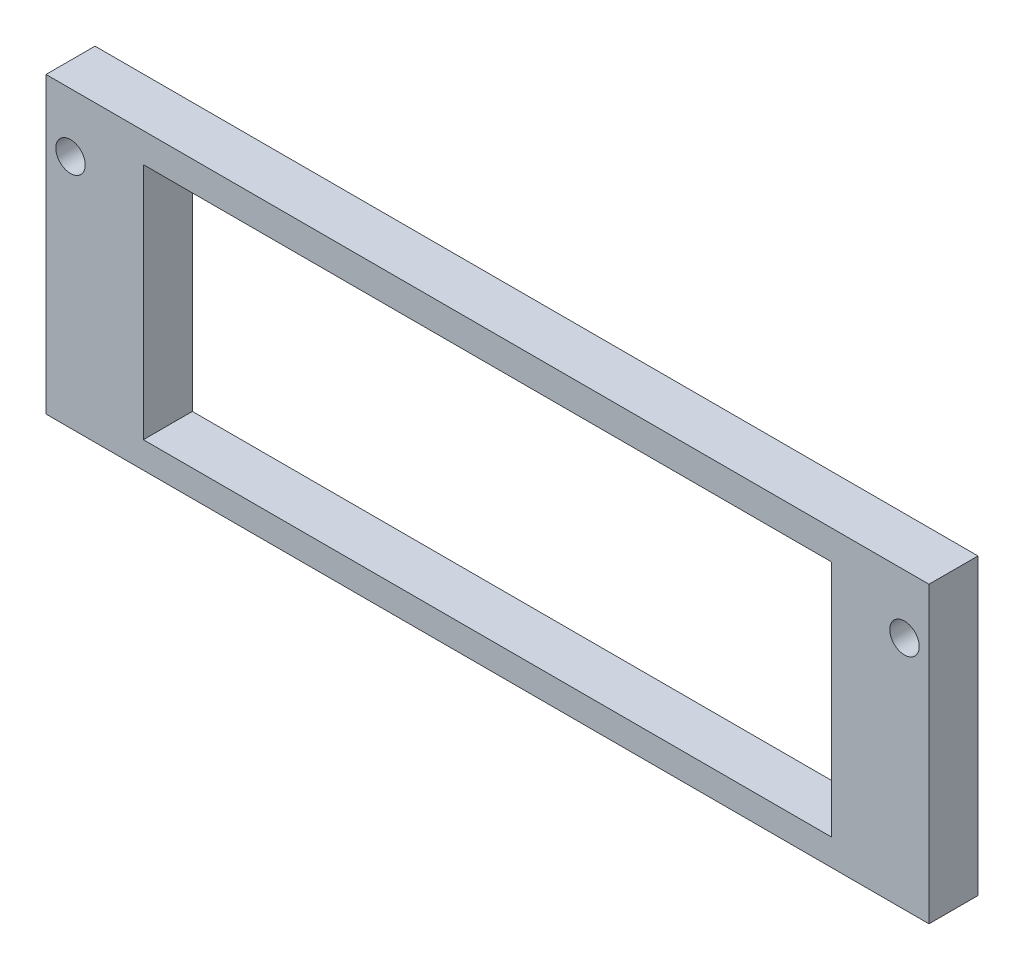
ISO-10303-21;
HEADER;
FILE_DESCRIPTION(('STEP AP214'),'2;1');
FILE_NAME('part.step','',(''),(''),'','','');
FILE_SCHEMA(('AUTOMOTIVE_DESIGN { 1 0 10303 214 1 1 1 1 }'));
ENDSEC;
DATA;
#1=APPLICATION_CONTEXT('core data for automotive mechanical design processes');
#2=APPLICATION_PROTOCOL_DEFINITION('international standard','automotive_design',2000,#1);
#3=PRODUCT_CONTEXT('',#1,'mechanical');
#4=PRODUCT('Part','Part','',(#3));
#5=PRODUCT_RELATED_PRODUCT_CATEGORY('part','',(#4));
#6=PRODUCT_DEFINITION_FORMATION('','',#4);
#7=PRODUCT_DEFINITION_CONTEXT('part definition',#1,'design');
#8=PRODUCT_DEFINITION('design','',#6,#7);
#9=PRODUCT_DEFINITION_SHAPE('','',#8);
#10=(LENGTH_UNIT() NAMED_UNIT(*) SI_UNIT(.MILLI.,.METRE.));
#11=(NAMED_UNIT(*) PLANE_ANGLE_UNIT() SI_UNIT($,.RADIAN.));
#12=(NAMED_UNIT(*) SI_UNIT($,.STERADIAN.) SOLID_ANGLE_UNIT());
#13=UNCERTAINTY_MEASURE_WITH_UNIT(LENGTH_MEASURE(1.E-05),#10,'distance_accuracy_value','');
#14=(GEOMETRIC_REPRESENTATION_CONTEXT(3) GLOBAL_UNCERTAINTY_ASSIGNED_CONTEXT((#13)) GLOBAL_UNIT_ASSIGNED_CONTEXT((#10,
#11,#12)) REPRESENTATION_CONTEXT('',''));
#15=CARTESIAN_POINT('',(0.,0.,0.));
#16=DIRECTION('',(0.,0.,1.));
#17=DIRECTION('',(1.,0.,0.));
#18=AXIS2_PLACEMENT_3D('',#15,#16,#17);
#19=CARTESIAN_POINT('',(-25.2209596765261,16.8623327741345,5.));
#20=DIRECTION('',(1.,0.,0.));
#21=DIRECTION('',(0.,1.,0.));
#22=AXIS2_PLACEMENT_3D('',#19,#20,#21);
#23=PLANE('',#22);
#24=DIRECTION('',(0.,-1.,0.));
#25=VECTOR('',#24,1.);
#26=CARTESIAN_POINT('',(-25.2209596765261,16.8623327741345,0.));
#27=LINE('',#26,#25);
#28=CARTESIAN_POINT('',(-25.2209596765261,16.8623327741345,0.));
#29=VERTEX_POINT('',#28);
#30=CARTESIAN_POINT('',(-25.2209596765261,-13.1376672258655,0.));
#31=VERTEX_POINT('',#30);
#32=EDGE_CURVE('E135',#29,#31,#27,.T.);
#33=ORIENTED_EDGE('',*,*,#32,.T.);
#34=DIRECTION('',(0.,0.,-1.));
#35=VECTOR('',#34,1.);
#36=CARTESIAN_POINT('',(-25.2209596765261,-13.1376672258655,5.));
#37=LINE('',#36,#35);
#38=CARTESIAN_POINT('',(-25.2209596765261,-13.1376672258655,5.));
#39=VERTEX_POINT('',#38);
#40=EDGE_CURVE('E11',#39,#31,#37,.T.);
#41=ORIENTED_EDGE('',*,*,#40,.F.);
#42=DIRECTION('',(0.,-1.,0.));
#43=VECTOR('',#42,1.);
#44=CARTESIAN_POINT('',(-25.2209596765261,16.8623327741345,5.));
#45=LINE('',#44,#43);
#46=CARTESIAN_POINT('',(-25.2209596765261,16.8623327741345,5.));
#47=VERTEX_POINT('',#46);
#48=EDGE_CURVE('E139',#47,#39,#45,.T.);
#49=ORIENTED_EDGE('',*,*,#48,.F.);
#50=DIRECTION('',(0.,0.,-1.));
#51=VECTOR('',#50,1.);
#52=CARTESIAN_POINT('',(-25.2209596765261,16.8623327741345,5.));
#53=LINE('',#52,#51);
#54=EDGE_CURVE('E149',#47,#29,#53,.T.);
#55=ORIENTED_EDGE('',*,*,#54,.T.);
#56=EDGE_LOOP('',(#33,#41,#49,#55));
#57=FACE_BOUND('',#56,.T.);
#58=ADVANCED_FACE('F35',(#57),#23,.F.);
#59=CARTESIAN_POINT('',(-25.2209596765261,-13.1376672258655,5.));
#60=DIRECTION('',(0.,1.,0.));
#61=DIRECTION('',(0.,0.,1.));
#62=AXIS2_PLACEMENT_3D('',#59,#60,#61);
#63=PLANE('',#62);
#64=DIRECTION('',(1.,0.,0.));
#65=VECTOR('',#64,1.);
#66=CARTESIAN_POINT('',(-25.2209596765261,-13.1376672258655,0.));
#67=LINE('',#66,#65);
#68=CARTESIAN_POINT('',(64.8390403234739,-13.1376672258655,0.));
#69=VERTEX_POINT('',#68);
#70=EDGE_CURVE('E152',#31,#69,#67,.T.);
#71=ORIENTED_EDGE('',*,*,#70,.T.);
#72=DIRECTION('',(0.,0.,-1.));
#73=VECTOR('',#72,1.);
#74=CARTESIAN_POINT('',(64.8390403234739,-13.1376672258655,5.));
#75=LINE('',#74,#73);
#76=CARTESIAN_POINT('',(64.8390403234739,-13.1376672258655,5.));
#77=VERTEX_POINT('',#76);
#78=EDGE_CURVE('E42',#77,#69,#75,.T.);
#79=ORIENTED_EDGE('',*,*,#78,.F.);
#80=DIRECTION('',(1.,0.,0.));
#81=VECTOR('',#80,1.);
#82=CARTESIAN_POINT('',(-25.2209596765261,-13.1376672258655,5.));
#83=LINE('',#82,#81);
#84=EDGE_CURVE('E142',#39,#77,#83,.T.);
#85=ORIENTED_EDGE('',*,*,#84,.F.);
#86=ORIENTED_EDGE('',*,*,#40,.T.);
#87=EDGE_LOOP('',(#71,#79,#85,#86));
#88=FACE_BOUND('',#87,.T.);
#89=ADVANCED_FACE('F180',(#88),#63,.F.);
#90=CARTESIAN_POINT('',(64.8390403234739,16.8623327741345,5.));
#91=DIRECTION('',(-1.,0.,0.));
#92=DIRECTION('',(0.,0.,1.));
#93=AXIS2_PLACEMENT_3D('',#90,#91,#92);
#94=PLANE('',#93);
#95=DIRECTION('',(0.,1.,0.));
#96=VECTOR('',#95,1.);
#97=CARTESIAN_POINT('',(64.8390403234739,16.8623327741345,0.));
#98=LINE('',#97,#96);
#99=CARTESIAN_POINT('',(64.8390403234739,16.8623327741345,0.));
#100=VERTEX_POINT('',#99);
#101=EDGE_CURVE('E154',#69,#100,#98,.T.);
#102=ORIENTED_EDGE('',*,*,#101,.T.);
#103=DIRECTION('',(0.,0.,-1.));
#104=VECTOR('',#103,1.);
#105=CARTESIAN_POINT('',(64.8390403234739,16.8623327741345,5.));
#106=LINE('',#105,#104);
#107=CARTESIAN_POINT('',(64.8390403234739,16.8623327741345,5.));
#108=VERTEX_POINT('',#107);
#109=EDGE_CURVE('E159',#108,#100,#106,.T.);
#110=ORIENTED_EDGE('',*,*,#109,.F.);
#111=DIRECTION('',(0.,1.,0.));
#112=VECTOR('',#111,1.);
#113=CARTESIAN_POINT('',(64.8390403234739,16.8623327741345,5.));
#114=LINE('',#113,#112);
#115=EDGE_CURVE('E145',#77,#108,#114,.T.);
#116=ORIENTED_EDGE('',*,*,#115,.F.);
#117=ORIENTED_EDGE('',*,*,#78,.T.);
#118=EDGE_LOOP('',(#102,#110,#116,#117));
#119=FACE_BOUND('',#118,.T.);
#120=ADVANCED_FACE('F166',(#119),#94,.F.);
#121=CARTESIAN_POINT('',(-25.2209596765261,16.8623327741345,5.));
#122=DIRECTION('',(0.,-1.,0.));
#123=DIRECTION('',(0.,0.,-1.));
#124=AXIS2_PLACEMENT_3D('',#121,#122,#123);
#125=PLANE('',#124);
#126=DIRECTION('',(-1.,0.,0.));
#127=VECTOR('',#126,1.);
#128=CARTESIAN_POINT('',(-25.2209596765261,16.8623327741345,0.));
#129=LINE('',#128,#127);
#130=EDGE_CURVE('E143',#100,#29,#129,.T.);
#131=ORIENTED_EDGE('',*,*,#130,.T.);
#132=ORIENTED_EDGE('',*,*,#54,.F.);
#133=DIRECTION('',(-1.,0.,0.));
#134=VECTOR('',#133,1.);
#135=CARTESIAN_POINT('',(-25.2209596765261,16.8623327741345,5.));
#136=LINE('',#135,#134);
#137=EDGE_CURVE('E147',#108,#47,#136,.T.);
#138=ORIENTED_EDGE('',*,*,#137,.F.);
#139=ORIENTED_EDGE('',*,*,#109,.T.);
#140=EDGE_LOOP('',(#131,#132,#138,#139));
#141=FACE_BOUND('',#140,.T.);
#142=ADVANCED_FACE('F175',(#141),#125,.F.);
#143=CARTESIAN_POINT('',(0.,0.,5.));
#144=DIRECTION('',(0.,0.,1.));
#145=DIRECTION('',(1.,0.,0.));
#146=AXIS2_PLACEMENT_3D('',#143,#144,#145);
#147=PLANE('',#146);
#148=CARTESIAN_POINT('',(62.3390403234738,10.8623327741345,5.));
#149=DIRECTION('',(0.,0.,1.));
#150=DIRECTION('',(1.,0.,0.));
#151=AXIS2_PLACEMENT_3D('',#148,#149,#150);
#152=CIRCLE('',#151,1.5);
#153=CARTESIAN_POINT('',(63.8390403234738,10.8623327741345,5.));
#154=VERTEX_POINT('',#153);
#155=EDGE_CURVE('E219',#154,#154,#152,.T.);
#156=ORIENTED_EDGE('',*,*,#155,.F.);
#157=EDGE_LOOP('',(#156));
#158=FACE_BOUND('',#157,.T.);
#159=CARTESIAN_POINT('',(-22.7209596765261,10.8623327741345,5.));
#160=DIRECTION('',(0.,0.,1.));
#161=DIRECTION('',(1.,0.,0.));
#162=AXIS2_PLACEMENT_3D('',#159,#160,#161);
#163=CIRCLE('',#162,1.5);
#164=CARTESIAN_POINT('',(-21.2209596765261,10.8623327741345,5.));
#165=VERTEX_POINT('',#164);
#166=EDGE_CURVE('E123',#165,#165,#163,.T.);
#167=ORIENTED_EDGE('',*,*,#166,.F.);
#168=EDGE_LOOP('',(#167));
#169=FACE_BOUND('',#168,.T.);
#170=DIRECTION('',(0.,-1.,0.));
#171=VECTOR('',#170,1.);
#172=CARTESIAN_POINT('',(54.9090403234739,13.8623327741345,5.));
#173=LINE('',#172,#171);
#174=CARTESIAN_POINT('',(54.9090403234739,13.8623327741345,5.));
#175=VERTEX_POINT('',#174);
#176=CARTESIAN_POINT('',(54.9090403234739,-10.4376672258655,5.));
#177=VERTEX_POINT('',#176);
#178=EDGE_CURVE('E101',#175,#177,#173,.T.);
#179=ORIENTED_EDGE('',*,*,#178,.T.);
#180=DIRECTION('',(-1.,0.,0.));
#181=VECTOR('',#180,1.);
#182=CARTESIAN_POINT('',(54.9090403234739,-10.4376672258655,5.));
#183=LINE('',#182,#181);
#184=CARTESIAN_POINT('',(-15.2909596765261,-10.4376672258655,5.));
#185=VERTEX_POINT('',#184);
#186=EDGE_CURVE('E110',#177,#185,#183,.T.);
#187=ORIENTED_EDGE('',*,*,#186,.T.);
#188=DIRECTION('',(0.,1.,0.));
#189=VECTOR('',#188,1.);
#190=CARTESIAN_POINT('',(-15.2909596765261,13.8623327741345,5.));
#191=LINE('',#190,#189);
#192=CARTESIAN_POINT('',(-15.2909596765261,13.8623327741345,5.));
#193=VERTEX_POINT('',#192);
#194=EDGE_CURVE('E49',#185,#193,#191,.T.);
#195=ORIENTED_EDGE('',*,*,#194,.T.);
#196=DIRECTION('',(1.,0.,0.));
#197=VECTOR('',#196,1.);
#198=CARTESIAN_POINT('',(54.9090403234739,13.8623327741345,5.));
#199=LINE('',#198,#197);
#200=EDGE_CURVE('E107',#193,#175,#199,.T.);
#201=ORIENTED_EDGE('',*,*,#200,.T.);
#202=EDGE_LOOP('',(#179,#187,#195,#201));
#203=FACE_BOUND('',#202,.T.);
#204=ORIENTED_EDGE('',*,*,#48,.T.);
#205=ORIENTED_EDGE('',*,*,#84,.T.);
#206=ORIENTED_EDGE('',*,*,#115,.T.);
#207=ORIENTED_EDGE('',*,*,#137,.T.);
#208=EDGE_LOOP('',(#204,#205,#206,#207));
#209=FACE_BOUND('',#208,.T.);
#210=ADVANCED_FACE('F114',(#158,#169,#203,#209),#147,.T.);
#211=CARTESIAN_POINT('',(0.,0.,0.));
#212=DIRECTION('',(0.,0.,1.));
#213=DIRECTION('',(1.,0.,0.));
#214=AXIS2_PLACEMENT_3D('',#211,#212,#213);
#215=PLANE('',#214);
#216=CARTESIAN_POINT('',(62.3390403234738,10.8623327741345,0.));
#217=DIRECTION('',(0.,0.,-1.));
#218=DIRECTION('',(-1.,0.,0.));
#219=AXIS2_PLACEMENT_3D('',#216,#217,#218);
#220=CIRCLE('',#219,1.5);
#221=CARTESIAN_POINT('',(60.8390403234738,10.8623327741345,0.));
#222=VERTEX_POINT('',#221);
#223=EDGE_CURVE('E222',#222,#222,#220,.T.);
#224=ORIENTED_EDGE('',*,*,#223,.F.);
#225=EDGE_LOOP('',(#224));
#226=FACE_BOUND('',#225,.T.);
#227=CARTESIAN_POINT('',(-22.7209596765261,10.8623327741345,0.));
#228=DIRECTION('',(0.,0.,-1.));
#229=DIRECTION('',(-1.,0.,0.));
#230=AXIS2_PLACEMENT_3D('',#227,#228,#229);
#231=CIRCLE('',#230,1.5);
#232=CARTESIAN_POINT('',(-24.2209596765261,10.8623327741345,0.));
#233=VERTEX_POINT('',#232);
#234=EDGE_CURVE('E224',#233,#233,#231,.T.);
#235=ORIENTED_EDGE('',*,*,#234,.F.);
#236=EDGE_LOOP('',(#235));
#237=FACE_BOUND('',#236,.T.);
#238=DIRECTION('',(-1.,0.,0.));
#239=VECTOR('',#238,1.);
#240=CARTESIAN_POINT('',(54.9090403234739,-10.4376672258655,0.));
#241=LINE('',#240,#239);
#242=CARTESIAN_POINT('',(54.9090403234739,-10.4376672258655,0.));
#243=VERTEX_POINT('',#242);
#244=CARTESIAN_POINT('',(-15.2909596765261,-10.4376672258655,0.));
#245=VERTEX_POINT('',#244);
#246=EDGE_CURVE('E129',#243,#245,#241,.T.);
#247=ORIENTED_EDGE('',*,*,#246,.F.);
#248=DIRECTION('',(0.,-1.,0.));
#249=VECTOR('',#248,1.);
#250=CARTESIAN_POINT('',(54.9090403234739,13.8623327741345,0.));
#251=LINE('',#250,#249);
#252=CARTESIAN_POINT('',(54.9090403234739,13.8623327741345,0.));
#253=VERTEX_POINT('',#252);
#254=EDGE_CURVE('E57',#253,#243,#251,.T.);
#255=ORIENTED_EDGE('',*,*,#254,.F.);
#256=DIRECTION('',(1.,0.,0.));
#257=VECTOR('',#256,1.);
#258=CARTESIAN_POINT('',(54.9090403234739,13.8623327741345,0.));
#259=LINE('',#258,#257);
#260=CARTESIAN_POINT('',(-15.2909596765261,13.8623327741345,0.));
#261=VERTEX_POINT('',#260);
#262=EDGE_CURVE('E117',#261,#253,#259,.T.);
#263=ORIENTED_EDGE('',*,*,#262,.F.);
#264=DIRECTION('',(0.,1.,0.));
#265=VECTOR('',#264,1.);
#266=CARTESIAN_POINT('',(-15.2909596765261,13.8623327741345,0.));
#267=LINE('',#266,#265);
#268=EDGE_CURVE('E120',#245,#261,#267,.T.);
#269=ORIENTED_EDGE('',*,*,#268,.F.);
#270=EDGE_LOOP('',(#247,#255,#263,#269));
#271=FACE_BOUND('',#270,.T.);
#272=ORIENTED_EDGE('',*,*,#32,.F.);
#273=ORIENTED_EDGE('',*,*,#130,.F.);
#274=ORIENTED_EDGE('',*,*,#101,.F.);
#275=ORIENTED_EDGE('',*,*,#70,.F.);
#276=EDGE_LOOP('',(#272,#273,#274,#275));
#277=FACE_BOUND('',#276,.T.);
#278=ADVANCED_FACE('F172',(#226,#237,#271,#277),#215,.F.);
#279=CARTESIAN_POINT('',(54.9090403234739,13.8623327741345,5.));
#280=DIRECTION('',(1.,0.,0.));
#281=DIRECTION('',(0.,1.,0.));
#282=AXIS2_PLACEMENT_3D('',#279,#280,#281);
#283=PLANE('',#282);
#284=ORIENTED_EDGE('',*,*,#254,.T.);
#285=DIRECTION('',(0.,0.,-1.));
#286=VECTOR('',#285,1.);
#287=CARTESIAN_POINT('',(54.9090403234739,-10.4376672258655,5.));
#288=LINE('',#287,#286);
#289=EDGE_CURVE('E97',#177,#243,#288,.T.);
#290=ORIENTED_EDGE('',*,*,#289,.F.);
#291=ORIENTED_EDGE('',*,*,#178,.F.);
#292=DIRECTION('',(0.,0.,-1.));
#293=VECTOR('',#292,1.);
#294=CARTESIAN_POINT('',(54.9090403234739,13.8623327741345,5.));
#295=LINE('',#294,#293);
#296=EDGE_CURVE('E133',#175,#253,#295,.T.);
#297=ORIENTED_EDGE('',*,*,#296,.T.);
#298=EDGE_LOOP('',(#284,#290,#291,#297));
#299=FACE_BOUND('',#298,.T.);
#300=ADVANCED_FACE('F99',(#299),#283,.F.);
#301=CARTESIAN_POINT('',(54.9090403234739,13.8623327741345,5.));
#302=DIRECTION('',(0.,1.,0.));
#303=DIRECTION('',(0.,0.,1.));
#304=AXIS2_PLACEMENT_3D('',#301,#302,#303);
#305=PLANE('',#304);
#306=ORIENTED_EDGE('',*,*,#262,.T.);
#307=ORIENTED_EDGE('',*,*,#296,.F.);
#308=ORIENTED_EDGE('',*,*,#200,.F.);
#309=DIRECTION('',(0.,0.,-1.));
#310=VECTOR('',#309,1.);
#311=CARTESIAN_POINT('',(-15.2909596765261,13.8623327741345,5.));
#312=LINE('',#311,#310);
#313=EDGE_CURVE('E136',#193,#261,#312,.T.);
#314=ORIENTED_EDGE('',*,*,#313,.T.);
#315=EDGE_LOOP('',(#306,#307,#308,#314));
#316=FACE_BOUND('',#315,.T.);
#317=ADVANCED_FACE('F198',(#316),#305,.F.);
#318=CARTESIAN_POINT('',(-15.2909596765261,13.8623327741345,5.));
#319=DIRECTION('',(-1.,0.,0.));
#320=DIRECTION('',(0.,-1.,0.));
#321=AXIS2_PLACEMENT_3D('',#318,#319,#320);
#322=PLANE('',#321);
#323=ORIENTED_EDGE('',*,*,#268,.T.);
#324=ORIENTED_EDGE('',*,*,#313,.F.);
#325=ORIENTED_EDGE('',*,*,#194,.F.);
#326=DIRECTION('',(0.,0.,-1.));
#327=VECTOR('',#326,1.);
#328=CARTESIAN_POINT('',(-15.2909596765261,-10.4376672258655,5.));
#329=LINE('',#328,#327);
#330=EDGE_CURVE('E106',#185,#245,#329,.T.);
#331=ORIENTED_EDGE('',*,*,#330,.T.);
#332=EDGE_LOOP('',(#323,#324,#325,#331));
#333=FACE_BOUND('',#332,.T.);
#334=ADVANCED_FACE('F202',(#333),#322,.F.);
#335=CARTESIAN_POINT('',(54.9090403234739,-10.4376672258655,5.));
#336=DIRECTION('',(0.,-1.,0.));
#337=DIRECTION('',(0.,0.,-1.));
#338=AXIS2_PLACEMENT_3D('',#335,#336,#337);
#339=PLANE('',#338);
#340=ORIENTED_EDGE('',*,*,#246,.T.);
#341=ORIENTED_EDGE('',*,*,#330,.F.);
#342=ORIENTED_EDGE('',*,*,#186,.F.);
#343=ORIENTED_EDGE('',*,*,#289,.T.);
#344=EDGE_LOOP('',(#340,#341,#342,#343));
#345=FACE_BOUND('',#344,.T.);
#346=ADVANCED_FACE('F111',(#345),#339,.F.);
#347=CARTESIAN_POINT('',(-22.7209596765261,10.8623327741345,10.));
#348=DIRECTION('',(0.,0.,-1.));
#349=DIRECTION('',(-1.,0.,0.));
#350=AXIS2_PLACEMENT_3D('',#347,#348,#349);
#351=CYLINDRICAL_SURFACE('',#350,1.5);
#352=ORIENTED_EDGE('',*,*,#166,.T.);
#353=EDGE_LOOP('',(#352));
#354=FACE_BOUND('',#353,.T.);
#355=ORIENTED_EDGE('',*,*,#234,.T.);
#356=EDGE_LOOP('',(#355));
#357=FACE_BOUND('',#356,.T.);
#358=ADVANCED_FACE('F201',(#354,#357),#351,.F.);
#359=CARTESIAN_POINT('',(62.3390403234738,10.8623327741345,10.));
#360=DIRECTION('',(0.,0.,-1.));
#361=DIRECTION('',(-1.,0.,0.));
#362=AXIS2_PLACEMENT_3D('',#359,#360,#361);
#363=CYLINDRICAL_SURFACE('',#362,1.5);
#364=ORIENTED_EDGE('',*,*,#155,.T.);
#365=EDGE_LOOP('',(#364));
#366=FACE_BOUND('',#365,.T.);
#367=ORIENTED_EDGE('',*,*,#223,.T.);
#368=EDGE_LOOP('',(#367));
#369=FACE_BOUND('',#368,.T.);
#370=ADVANCED_FACE('F210',(#366,#369),#363,.F.);
#371=CLOSED_SHELL('',(#58,#89,#120,#142,#210,#278,#300,#317,#334,#346,#358,#370));
#372=MANIFOLD_SOLID_BREP('B2',#371);
#373=ADVANCED_BREP_SHAPE_REPRESENTATION('',(#18,#372),#14);
#374=SHAPE_DEFINITION_REPRESENTATION(#9,#373);
ENDSEC;
END-ISO-10303-21;
